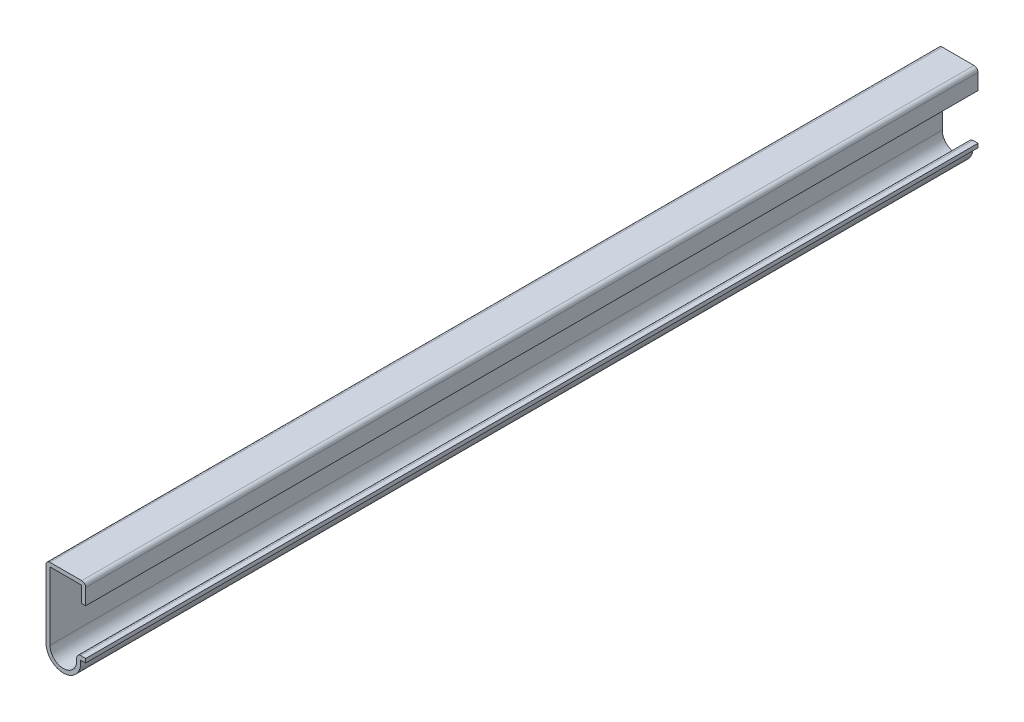
ISO-10303-21;
HEADER;
FILE_DESCRIPTION(('STEP AP214'),'2;1');
FILE_NAME('part.step','',(''),(''),'','','');
FILE_SCHEMA(('AUTOMOTIVE_DESIGN { 1 0 10303 214 1 1 1 1 }'));
ENDSEC;
DATA;
#1=APPLICATION_CONTEXT('core data for automotive mechanical design processes');
#2=APPLICATION_PROTOCOL_DEFINITION('international standard','automotive_design',2000,#1);
#3=PRODUCT_CONTEXT('',#1,'mechanical');
#4=PRODUCT('Part','Part','',(#3));
#5=PRODUCT_RELATED_PRODUCT_CATEGORY('part','',(#4));
#6=PRODUCT_DEFINITION_FORMATION('','',#4);
#7=PRODUCT_DEFINITION_CONTEXT('part definition',#1,'design');
#8=PRODUCT_DEFINITION('design','',#6,#7);
#9=PRODUCT_DEFINITION_SHAPE('','',#8);
#10=(LENGTH_UNIT() NAMED_UNIT(*) SI_UNIT(.MILLI.,.METRE.));
#11=(NAMED_UNIT(*) PLANE_ANGLE_UNIT() SI_UNIT($,.RADIAN.));
#12=(NAMED_UNIT(*) SI_UNIT($,.STERADIAN.) SOLID_ANGLE_UNIT());
#13=UNCERTAINTY_MEASURE_WITH_UNIT(LENGTH_MEASURE(1.E-05),#10,'distance_accuracy_value','');
#14=(GEOMETRIC_REPRESENTATION_CONTEXT(3) GLOBAL_UNCERTAINTY_ASSIGNED_CONTEXT((#13)) GLOBAL_UNIT_ASSIGNED_CONTEXT((#10,
#11,#12)) REPRESENTATION_CONTEXT('',''));
#15=CARTESIAN_POINT('',(0.,0.,0.));
#16=DIRECTION('',(0.,0.,1.));
#17=DIRECTION('',(1.,0.,0.));
#18=AXIS2_PLACEMENT_3D('',#15,#16,#17);
#19=CARTESIAN_POINT('',(-1.27,22.225,-285.75));
#20=DIRECTION('',(-1.,0.,0.));
#21=DIRECTION('',(0.,-1.,0.));
#22=AXIS2_PLACEMENT_3D('',#19,#20,#21);
#23=PLANE('',#22);
#24=DIRECTION('',(0.,-1.,0.));
#25=VECTOR('',#24,1.);
#26=CARTESIAN_POINT('',(-1.27,22.225,0.));
#27=LINE('',#26,#25);
#28=CARTESIAN_POINT('',(-1.27,20.955,0.));
#29=VERTEX_POINT('',#28);
#30=CARTESIAN_POINT('',(-1.27,15.875,0.));
#31=VERTEX_POINT('',#30);
#32=EDGE_CURVE('E235',#29,#31,#27,.T.);
#33=ORIENTED_EDGE('',*,*,#32,.F.);
#34=DIRECTION('',(0.,0.,1.));
#35=VECTOR('',#34,1.);
#36=CARTESIAN_POINT('',(-1.27,20.955,-285.75));
#37=LINE('',#36,#35);
#38=CARTESIAN_POINT('',(-1.27,20.955,-285.75));
#39=VERTEX_POINT('',#38);
#40=EDGE_CURVE('E190',#39,#29,#37,.T.);
#41=ORIENTED_EDGE('',*,*,#40,.F.);
#42=DIRECTION('',(0.,-1.,0.));
#43=VECTOR('',#42,1.);
#44=CARTESIAN_POINT('',(-1.27,22.225,-285.75));
#45=LINE('',#44,#43);
#46=CARTESIAN_POINT('',(-1.27,15.875,-285.75));
#47=VERTEX_POINT('',#46);
#48=EDGE_CURVE('E169',#39,#47,#45,.T.);
#49=ORIENTED_EDGE('',*,*,#48,.T.);
#50=DIRECTION('',(0.,0.,1.));
#51=VECTOR('',#50,1.);
#52=CARTESIAN_POINT('',(-1.27,15.875,-285.75));
#53=LINE('',#52,#51);
#54=EDGE_CURVE('E179',#47,#31,#53,.T.);
#55=ORIENTED_EDGE('',*,*,#54,.T.);
#56=EDGE_LOOP('',(#33,#41,#49,#55));
#57=FACE_BOUND('',#56,.T.);
#58=ADVANCED_FACE('F41',(#57),#23,.T.);
#59=CARTESIAN_POINT('',(-12.7,20.955,-285.75));
#60=DIRECTION('',(0.,-1.,0.));
#61=DIRECTION('',(0.,0.,-1.));
#62=AXIS2_PLACEMENT_3D('',#59,#60,#61);
#63=PLANE('',#62);
#64=DIRECTION('',(1.,0.,0.));
#65=VECTOR('',#64,1.);
#66=CARTESIAN_POINT('',(-12.7,20.955,0.));
#67=LINE('',#66,#65);
#68=CARTESIAN_POINT('',(-11.43,20.955,0.));
#69=VERTEX_POINT('',#68);
#70=EDGE_CURVE('E192',#69,#29,#67,.T.);
#71=ORIENTED_EDGE('',*,*,#70,.F.);
#72=DIRECTION('',(0.,0.,1.));
#73=VECTOR('',#72,1.);
#74=CARTESIAN_POINT('',(-11.43,20.955,-285.75));
#75=LINE('',#74,#73);
#76=CARTESIAN_POINT('',(-11.43,20.955,-285.75));
#77=VERTEX_POINT('',#76);
#78=EDGE_CURVE('E279',#77,#69,#75,.T.);
#79=ORIENTED_EDGE('',*,*,#78,.F.);
#80=DIRECTION('',(1.,0.,0.));
#81=VECTOR('',#80,1.);
#82=CARTESIAN_POINT('',(-12.7,20.955,-285.75));
#83=LINE('',#82,#81);
#84=EDGE_CURVE('E188',#77,#39,#83,.T.);
#85=ORIENTED_EDGE('',*,*,#84,.T.);
#86=ORIENTED_EDGE('',*,*,#40,.T.);
#87=EDGE_LOOP('',(#71,#79,#85,#86));
#88=FACE_BOUND('',#87,.T.);
#89=ADVANCED_FACE('F389',(#88),#63,.T.);
#90=CARTESIAN_POINT('',(-11.43,-0.793750000000003,-285.75));
#91=DIRECTION('',(1.,0.,0.));
#92=DIRECTION('',(0.,0.,-1.));
#93=AXIS2_PLACEMENT_3D('',#90,#91,#92);
#94=PLANE('',#93);
#95=DIRECTION('',(0.,1.,0.));
#96=VECTOR('',#95,1.);
#97=CARTESIAN_POINT('',(-11.43,-0.793750000000003,0.));
#98=LINE('',#97,#96);
#99=CARTESIAN_POINT('',(-11.43,-0.793750000000003,0.));
#100=VERTEX_POINT('',#99);
#101=EDGE_CURVE('E196',#100,#69,#98,.T.);
#102=ORIENTED_EDGE('',*,*,#101,.F.);
#103=DIRECTION('',(0.,0.,1.));
#104=VECTOR('',#103,1.);
#105=CARTESIAN_POINT('',(-11.43,-0.793750000000003,-285.75));
#106=LINE('',#105,#104);
#107=CARTESIAN_POINT('',(-11.43,-0.793750000000003,-285.75));
#108=VERTEX_POINT('',#107);
#109=EDGE_CURVE('E282',#108,#100,#106,.T.);
#110=ORIENTED_EDGE('',*,*,#109,.F.);
#111=DIRECTION('',(0.,1.,0.));
#112=VECTOR('',#111,1.);
#113=CARTESIAN_POINT('',(-11.43,-0.793750000000003,-285.75));
#114=LINE('',#113,#112);
#115=EDGE_CURVE('E229',#108,#77,#114,.T.);
#116=ORIENTED_EDGE('',*,*,#115,.T.);
#117=ORIENTED_EDGE('',*,*,#78,.T.);
#118=EDGE_LOOP('',(#102,#110,#116,#117));
#119=FACE_BOUND('',#118,.T.);
#120=ADVANCED_FACE('F409',(#119),#94,.T.);
#121=CARTESIAN_POINT('',(-7.14375,-0.793750000000003,-285.75));
#122=DIRECTION('',(0.,0.,1.));
#123=DIRECTION('',(1.,0.,0.));
#124=AXIS2_PLACEMENT_3D('',#121,#122,#123);
#125=CYLINDRICAL_SURFACE('',#124,4.28625);
#126=CARTESIAN_POINT('',(-7.14375,-0.793750000000003,0.));
#127=DIRECTION('',(0.,0.,1.));
#128=DIRECTION('',(1.,0.,0.));
#129=AXIS2_PLACEMENT_3D('',#126,#127,#128);
#130=CIRCLE('',#129,4.28625);
#131=CARTESIAN_POINT('',(-2.8575,-0.793750000000003,0.));
#132=VERTEX_POINT('',#131);
#133=EDGE_CURVE('E269',#132,#100,#130,.F.);
#134=ORIENTED_EDGE('',*,*,#133,.F.);
#135=DIRECTION('',(0.,0.,1.));
#136=VECTOR('',#135,1.);
#137=CARTESIAN_POINT('',(-2.8575,-0.793750000000003,-285.75));
#138=LINE('',#137,#136);
#139=CARTESIAN_POINT('',(-2.8575,-0.793750000000003,-285.75));
#140=VERTEX_POINT('',#139);
#141=EDGE_CURVE('E285',#140,#132,#138,.T.);
#142=ORIENTED_EDGE('',*,*,#141,.F.);
#143=CARTESIAN_POINT('',(-7.14375,-0.793750000000003,-285.75));
#144=DIRECTION('',(0.,0.,1.));
#145=DIRECTION('',(1.,0.,0.));
#146=AXIS2_PLACEMENT_3D('',#143,#144,#145);
#147=CIRCLE('',#146,4.28625);
#148=EDGE_CURVE('E225',#140,#108,#147,.F.);
#149=ORIENTED_EDGE('',*,*,#148,.T.);
#150=ORIENTED_EDGE('',*,*,#109,.T.);
#151=EDGE_LOOP('',(#134,#142,#149,#150));
#152=FACE_BOUND('',#151,.T.);
#153=ADVANCED_FACE('F396',(#152),#125,.F.);
#154=CARTESIAN_POINT('',(-2.8575,0.,-285.75));
#155=DIRECTION('',(-1.,0.,0.));
#156=DIRECTION('',(0.,-1.,0.));
#157=AXIS2_PLACEMENT_3D('',#154,#155,#156);
#158=PLANE('',#157);
#159=DIRECTION('',(0.,-1.,0.));
#160=VECTOR('',#159,1.);
#161=CARTESIAN_POINT('',(-2.8575,0.,0.));
#162=LINE('',#161,#160);
#163=CARTESIAN_POINT('',(-2.8575,0.,0.));
#164=VERTEX_POINT('',#163);
#165=EDGE_CURVE('E266',#164,#132,#162,.T.);
#166=ORIENTED_EDGE('',*,*,#165,.F.);
#167=DIRECTION('',(0.,0.,1.));
#168=VECTOR('',#167,1.);
#169=CARTESIAN_POINT('',(-2.8575,0.,-285.75));
#170=LINE('',#169,#168);
#171=CARTESIAN_POINT('',(-2.8575,0.,-285.75));
#172=VERTEX_POINT('',#171);
#173=EDGE_CURVE('E11',#164,#172,#170,.F.);
#174=ORIENTED_EDGE('',*,*,#173,.T.);
#175=DIRECTION('',(0.,-1.,0.));
#176=VECTOR('',#175,1.);
#177=CARTESIAN_POINT('',(-2.8575,0.,-285.75));
#178=LINE('',#177,#176);
#179=EDGE_CURVE('E222',#172,#140,#178,.T.);
#180=ORIENTED_EDGE('',*,*,#179,.T.);
#181=ORIENTED_EDGE('',*,*,#141,.T.);
#182=EDGE_LOOP('',(#166,#174,#180,#181));
#183=FACE_BOUND('',#182,.T.);
#184=ADVANCED_FACE('F398',(#183),#158,.T.);
#185=CARTESIAN_POINT('',(0.,1.27,-285.75));
#186=DIRECTION('',(0.,1.,0.));
#187=DIRECTION('',(-1.,0.,0.));
#188=AXIS2_PLACEMENT_3D('',#185,#186,#187);
#189=PLANE('',#188);
#190=DIRECTION('',(-1.,0.,0.));
#191=VECTOR('',#190,1.);
#192=CARTESIAN_POINT('',(0.,1.27,-285.75));
#193=LINE('',#192,#191);
#194=CARTESIAN_POINT('',(0.,1.27,-285.75));
#195=VERTEX_POINT('',#194);
#196=CARTESIAN_POINT('',(-1.5875,1.27,-285.75));
#197=VERTEX_POINT('',#196);
#198=EDGE_CURVE('E219',#195,#197,#193,.T.);
#199=ORIENTED_EDGE('',*,*,#198,.T.);
#200=DIRECTION('',(0.,0.,1.));
#201=VECTOR('',#200,1.);
#202=CARTESIAN_POINT('',(-1.5875,1.27,-285.75));
#203=LINE('',#202,#201);
#204=CARTESIAN_POINT('',(-1.5875,1.27,0.));
#205=VERTEX_POINT('',#204);
#206=EDGE_CURVE('E50',#197,#205,#203,.T.);
#207=ORIENTED_EDGE('',*,*,#206,.T.);
#208=DIRECTION('',(-1.,0.,0.));
#209=VECTOR('',#208,1.);
#210=CARTESIAN_POINT('',(0.,1.27,0.));
#211=LINE('',#210,#209);
#212=CARTESIAN_POINT('',(0.,1.27,0.));
#213=VERTEX_POINT('',#212);
#214=EDGE_CURVE('E262',#213,#205,#211,.T.);
#215=ORIENTED_EDGE('',*,*,#214,.F.);
#216=DIRECTION('',(0.,0.,1.));
#217=VECTOR('',#216,1.);
#218=CARTESIAN_POINT('',(0.,1.27,-285.75));
#219=LINE('',#218,#217);
#220=EDGE_CURVE('E289',#195,#213,#219,.T.);
#221=ORIENTED_EDGE('',*,*,#220,.F.);
#222=EDGE_LOOP('',(#199,#207,#215,#221));
#223=FACE_BOUND('',#222,.T.);
#224=ADVANCED_FACE('F343',(#223),#189,.T.);
#225=CARTESIAN_POINT('',(0.,1.27,-285.75));
#226=DIRECTION('',(-1.,0.,0.));
#227=DIRECTION('',(0.,-1.,0.));
#228=AXIS2_PLACEMENT_3D('',#225,#226,#227);
#229=PLANE('',#228);
#230=DIRECTION('',(0.,-1.,0.));
#231=VECTOR('',#230,1.);
#232=CARTESIAN_POINT('',(0.,1.27,0.));
#233=LINE('',#232,#231);
#234=CARTESIAN_POINT('',(0.,0.,0.));
#235=VERTEX_POINT('',#234);
#236=EDGE_CURVE('E259',#213,#235,#233,.T.);
#237=ORIENTED_EDGE('',*,*,#236,.T.);
#238=DIRECTION('',(0.,0.,1.));
#239=VECTOR('',#238,1.);
#240=CARTESIAN_POINT('',(0.,0.,-285.75));
#241=LINE('',#240,#239);
#242=CARTESIAN_POINT('',(0.,0.,-285.75));
#243=VERTEX_POINT('',#242);
#244=EDGE_CURVE('E292',#243,#235,#241,.T.);
#245=ORIENTED_EDGE('',*,*,#244,.F.);
#246=DIRECTION('',(0.,-1.,0.));
#247=VECTOR('',#246,1.);
#248=CARTESIAN_POINT('',(0.,1.27,-285.75));
#249=LINE('',#248,#247);
#250=EDGE_CURVE('E216',#195,#243,#249,.T.);
#251=ORIENTED_EDGE('',*,*,#250,.F.);
#252=ORIENTED_EDGE('',*,*,#220,.T.);
#253=EDGE_LOOP('',(#237,#245,#251,#252));
#254=FACE_BOUND('',#253,.T.);
#255=ADVANCED_FACE('F354',(#254),#229,.F.);
#256=CARTESIAN_POINT('',(0.,0.,-285.75));
#257=DIRECTION('',(0.,1.,0.));
#258=DIRECTION('',(-1.,0.,0.));
#259=AXIS2_PLACEMENT_3D('',#256,#257,#258);
#260=PLANE('',#259);
#261=DIRECTION('',(-1.,0.,0.));
#262=VECTOR('',#261,1.);
#263=CARTESIAN_POINT('',(0.,0.,0.));
#264=LINE('',#263,#262);
#265=CARTESIAN_POINT('',(-1.5875,0.,0.));
#266=VERTEX_POINT('',#265);
#267=EDGE_CURVE('E256',#235,#266,#264,.T.);
#268=ORIENTED_EDGE('',*,*,#267,.T.);
#269=DIRECTION('',(0.,0.,1.));
#270=VECTOR('',#269,1.);
#271=CARTESIAN_POINT('',(-1.5875,0.,-285.75));
#272=LINE('',#271,#270);
#273=CARTESIAN_POINT('',(-1.5875,0.,-285.75));
#274=VERTEX_POINT('',#273);
#275=EDGE_CURVE('E296',#274,#266,#272,.T.);
#276=ORIENTED_EDGE('',*,*,#275,.F.);
#277=DIRECTION('',(-1.,0.,0.));
#278=VECTOR('',#277,1.);
#279=CARTESIAN_POINT('',(0.,0.,-285.75));
#280=LINE('',#279,#278);
#281=EDGE_CURVE('E213',#243,#274,#280,.T.);
#282=ORIENTED_EDGE('',*,*,#281,.F.);
#283=ORIENTED_EDGE('',*,*,#244,.T.);
#284=EDGE_LOOP('',(#268,#276,#282,#283));
#285=FACE_BOUND('',#284,.T.);
#286=ADVANCED_FACE('F358',(#285),#260,.F.);
#287=CARTESIAN_POINT('',(-1.5875,0.,-285.75));
#288=DIRECTION('',(-1.,0.,0.));
#289=DIRECTION('',(0.,-1.,0.));
#290=AXIS2_PLACEMENT_3D('',#287,#288,#289);
#291=PLANE('',#290);
#292=DIRECTION('',(0.,-1.,0.));
#293=VECTOR('',#292,1.);
#294=CARTESIAN_POINT('',(-1.5875,0.,0.));
#295=LINE('',#294,#293);
#296=CARTESIAN_POINT('',(-1.5875,-0.793750000000003,0.));
#297=VERTEX_POINT('',#296);
#298=EDGE_CURVE('E253',#266,#297,#295,.T.);
#299=ORIENTED_EDGE('',*,*,#298,.T.);
#300=DIRECTION('',(0.,0.,1.));
#301=VECTOR('',#300,1.);
#302=CARTESIAN_POINT('',(-1.5875,-0.793750000000003,-285.75));
#303=LINE('',#302,#301);
#304=CARTESIAN_POINT('',(-1.5875,-0.793750000000003,-285.75));
#305=VERTEX_POINT('',#304);
#306=EDGE_CURVE('E300',#305,#297,#303,.T.);
#307=ORIENTED_EDGE('',*,*,#306,.F.);
#308=DIRECTION('',(0.,-1.,0.));
#309=VECTOR('',#308,1.);
#310=CARTESIAN_POINT('',(-1.5875,0.,-285.75));
#311=LINE('',#310,#309);
#312=EDGE_CURVE('E210',#274,#305,#311,.T.);
#313=ORIENTED_EDGE('',*,*,#312,.F.);
#314=ORIENTED_EDGE('',*,*,#275,.T.);
#315=EDGE_LOOP('',(#299,#307,#313,#314));
#316=FACE_BOUND('',#315,.T.);
#317=ADVANCED_FACE('F365',(#316),#291,.F.);
#318=CARTESIAN_POINT('',(-7.14375,-0.793750000000003,-285.75));
#319=DIRECTION('',(0.,0.,1.));
#320=DIRECTION('',(1.,0.,0.));
#321=AXIS2_PLACEMENT_3D('',#318,#319,#320);
#322=CYLINDRICAL_SURFACE('',#321,5.55625);
#323=CARTESIAN_POINT('',(-7.14375,-0.793750000000003,0.));
#324=DIRECTION('',(0.,0.,-1.));
#325=DIRECTION('',(-1.,0.,0.));
#326=AXIS2_PLACEMENT_3D('',#323,#324,#325);
#327=CIRCLE('',#326,5.55625);
#328=CARTESIAN_POINT('',(-12.7,-0.793750000000003,0.));
#329=VERTEX_POINT('',#328);
#330=EDGE_CURVE('E250',#297,#329,#327,.T.);
#331=ORIENTED_EDGE('',*,*,#330,.T.);
#332=DIRECTION('',(0.,0.,1.));
#333=VECTOR('',#332,1.);
#334=CARTESIAN_POINT('',(-12.7,-0.793750000000003,-285.75));
#335=LINE('',#334,#333);
#336=CARTESIAN_POINT('',(-12.7,-0.793750000000003,-285.75));
#337=VERTEX_POINT('',#336);
#338=EDGE_CURVE('E304',#337,#329,#335,.T.);
#339=ORIENTED_EDGE('',*,*,#338,.F.);
#340=CARTESIAN_POINT('',(-7.14375,-0.793750000000003,-285.75));
#341=DIRECTION('',(0.,0.,-1.));
#342=DIRECTION('',(-1.,0.,0.));
#343=AXIS2_PLACEMENT_3D('',#340,#341,#342);
#344=CIRCLE('',#343,5.55625);
#345=EDGE_CURVE('E207',#305,#337,#344,.T.);
#346=ORIENTED_EDGE('',*,*,#345,.F.);
#347=ORIENTED_EDGE('',*,*,#306,.T.);
#348=EDGE_LOOP('',(#331,#339,#346,#347));
#349=FACE_BOUND('',#348,.T.);
#350=ADVANCED_FACE('F368',(#349),#322,.T.);
#351=CARTESIAN_POINT('',(-12.7,-0.793750000000003,-285.75));
#352=DIRECTION('',(1.,0.,0.));
#353=DIRECTION('',(0.,0.,-1.));
#354=AXIS2_PLACEMENT_3D('',#351,#352,#353);
#355=PLANE('',#354);
#356=DIRECTION('',(0.,1.,0.));
#357=VECTOR('',#356,1.);
#358=CARTESIAN_POINT('',(-12.7,-0.793750000000003,0.));
#359=LINE('',#358,#357);
#360=CARTESIAN_POINT('',(-12.7,20.955,0.));
#361=VERTEX_POINT('',#360);
#362=EDGE_CURVE('E247',#329,#361,#359,.T.);
#363=ORIENTED_EDGE('',*,*,#362,.T.);
#364=DIRECTION('',(0.,0.,1.));
#365=VECTOR('',#364,1.);
#366=CARTESIAN_POINT('',(-12.7,20.955,-285.75));
#367=LINE('',#366,#365);
#368=CARTESIAN_POINT('',(-12.7,20.955,-285.75));
#369=VERTEX_POINT('',#368);
#370=EDGE_CURVE('E57',#361,#369,#367,.F.);
#371=ORIENTED_EDGE('',*,*,#370,.T.);
#372=DIRECTION('',(0.,1.,0.));
#373=VECTOR('',#372,1.);
#374=CARTESIAN_POINT('',(-12.7,-0.793750000000003,-285.75));
#375=LINE('',#374,#373);
#376=EDGE_CURVE('E204',#337,#369,#375,.T.);
#377=ORIENTED_EDGE('',*,*,#376,.F.);
#378=ORIENTED_EDGE('',*,*,#338,.T.);
#379=EDGE_LOOP('',(#363,#371,#377,#378));
#380=FACE_BOUND('',#379,.T.);
#381=ADVANCED_FACE('F370',(#380),#355,.F.);
#382=CARTESIAN_POINT('',(-12.7,22.225,-285.75));
#383=DIRECTION('',(0.,-1.,0.));
#384=DIRECTION('',(0.,0.,-1.));
#385=AXIS2_PLACEMENT_3D('',#382,#383,#384);
#386=PLANE('',#385);
#387=DIRECTION('',(1.,0.,0.));
#388=VECTOR('',#387,1.);
#389=CARTESIAN_POINT('',(-12.7,22.225,0.));
#390=LINE('',#389,#388);
#391=CARTESIAN_POINT('',(-11.43,22.225,0.));
#392=VERTEX_POINT('',#391);
#393=CARTESIAN_POINT('',(-1.27,22.225,0.));
#394=VERTEX_POINT('',#393);
#395=EDGE_CURVE('E243',#392,#394,#390,.T.);
#396=ORIENTED_EDGE('',*,*,#395,.T.);
#397=DIRECTION('',(0.,0.,1.));
#398=VECTOR('',#397,1.);
#399=CARTESIAN_POINT('',(-1.27,22.225,-285.75));
#400=LINE('',#399,#398);
#401=CARTESIAN_POINT('',(-1.27,22.225,-285.75));
#402=VERTEX_POINT('',#401);
#403=EDGE_CURVE('E326',#394,#402,#400,.F.);
#404=ORIENTED_EDGE('',*,*,#403,.T.);
#405=DIRECTION('',(1.,0.,0.));
#406=VECTOR('',#405,1.);
#407=CARTESIAN_POINT('',(-12.7,22.225,-285.75));
#408=LINE('',#407,#406);
#409=CARTESIAN_POINT('',(-11.43,22.225,-285.75));
#410=VERTEX_POINT('',#409);
#411=EDGE_CURVE('E201',#410,#402,#408,.T.);
#412=ORIENTED_EDGE('',*,*,#411,.F.);
#413=DIRECTION('',(0.,0.,1.));
#414=VECTOR('',#413,1.);
#415=CARTESIAN_POINT('',(-11.43,22.225,-285.75));
#416=LINE('',#415,#414);
#417=EDGE_CURVE('E322',#410,#392,#416,.T.);
#418=ORIENTED_EDGE('',*,*,#417,.T.);
#419=EDGE_LOOP('',(#396,#404,#412,#418));
#420=FACE_BOUND('',#419,.T.);
#421=ADVANCED_FACE('F378',(#420),#386,.F.);
#422=CARTESIAN_POINT('',(0.,22.225,-285.75));
#423=DIRECTION('',(-1.,0.,0.));
#424=DIRECTION('',(0.,-1.,0.));
#425=AXIS2_PLACEMENT_3D('',#422,#423,#424);
#426=PLANE('',#425);
#427=DIRECTION('',(0.,-1.,0.));
#428=VECTOR('',#427,1.);
#429=CARTESIAN_POINT('',(0.,22.225,-285.75));
#430=LINE('',#429,#428);
#431=CARTESIAN_POINT('',(0.,20.955,-285.75));
#432=VERTEX_POINT('',#431);
#433=CARTESIAN_POINT('',(0.,15.875,-285.75));
#434=VERTEX_POINT('',#433);
#435=EDGE_CURVE('E172',#432,#434,#430,.T.);
#436=ORIENTED_EDGE('',*,*,#435,.F.);
#437=DIRECTION('',(0.,0.,1.));
#438=VECTOR('',#437,1.);
#439=CARTESIAN_POINT('',(0.,20.955,-285.75));
#440=LINE('',#439,#438);
#441=CARTESIAN_POINT('',(0.,20.955,0.));
#442=VERTEX_POINT('',#441);
#443=EDGE_CURVE('E278',#432,#442,#440,.T.);
#444=ORIENTED_EDGE('',*,*,#443,.T.);
#445=DIRECTION('',(0.,-1.,0.));
#446=VECTOR('',#445,1.);
#447=CARTESIAN_POINT('',(0.,22.225,0.));
#448=LINE('',#447,#446);
#449=CARTESIAN_POINT('',(0.,15.875,0.));
#450=VERTEX_POINT('',#449);
#451=EDGE_CURVE('E240',#442,#450,#448,.T.);
#452=ORIENTED_EDGE('',*,*,#451,.T.);
#453=DIRECTION('',(0.,0.,1.));
#454=VECTOR('',#453,1.);
#455=CARTESIAN_POINT('',(0.,15.875,-285.75));
#456=LINE('',#455,#454);
#457=EDGE_CURVE('E187',#434,#450,#456,.T.);
#458=ORIENTED_EDGE('',*,*,#457,.F.);
#459=EDGE_LOOP('',(#436,#444,#452,#458));
#460=FACE_BOUND('',#459,.T.);
#461=ADVANCED_FACE('F385',(#460),#426,.F.);
#462=CARTESIAN_POINT('',(0.,15.875,-285.75));
#463=DIRECTION('',(0.,1.,0.));
#464=DIRECTION('',(0.,0.,1.));
#465=AXIS2_PLACEMENT_3D('',#462,#463,#464);
#466=PLANE('',#465);
#467=DIRECTION('',(-1.,0.,0.));
#468=VECTOR('',#467,1.);
#469=CARTESIAN_POINT('',(0.,15.875,0.));
#470=LINE('',#469,#468);
#471=EDGE_CURVE('E182',#450,#31,#470,.T.);
#472=ORIENTED_EDGE('',*,*,#471,.T.);
#473=ORIENTED_EDGE('',*,*,#54,.F.);
#474=DIRECTION('',(-1.,0.,0.));
#475=VECTOR('',#474,1.);
#476=CARTESIAN_POINT('',(0.,15.875,-285.75));
#477=LINE('',#476,#475);
#478=EDGE_CURVE('E163',#434,#47,#477,.T.);
#479=ORIENTED_EDGE('',*,*,#478,.F.);
#480=ORIENTED_EDGE('',*,*,#457,.T.);
#481=EDGE_LOOP('',(#472,#473,#479,#480));
#482=FACE_BOUND('',#481,.T.);
#483=ADVANCED_FACE('F180',(#482),#466,.F.);
#484=CARTESIAN_POINT('',(-7.14375,-0.793750000000003,-285.75));
#485=DIRECTION('',(0.,0.,-1.));
#486=DIRECTION('',(-1.,0.,0.));
#487=AXIS2_PLACEMENT_3D('',#484,#485,#486);
#488=PLANE('',#487);
#489=ORIENTED_EDGE('',*,*,#411,.T.);
#490=CARTESIAN_POINT('',(-1.27,20.955,-285.75));
#491=DIRECTION('',(0.,0.,-1.));
#492=DIRECTION('',(-1.,0.,0.));
#493=AXIS2_PLACEMENT_3D('',#490,#491,#492);
#494=CIRCLE('',#493,1.27);
#495=EDGE_CURVE('E334',#402,#432,#494,.T.);
#496=ORIENTED_EDGE('',*,*,#495,.T.);
#497=ORIENTED_EDGE('',*,*,#435,.T.);
#498=ORIENTED_EDGE('',*,*,#478,.T.);
#499=ORIENTED_EDGE('',*,*,#48,.F.);
#500=ORIENTED_EDGE('',*,*,#84,.F.);
#501=ORIENTED_EDGE('',*,*,#115,.F.);
#502=ORIENTED_EDGE('',*,*,#148,.F.);
#503=ORIENTED_EDGE('',*,*,#179,.F.);
#504=CARTESIAN_POINT('',(-1.5875,0.,-285.75));
#505=DIRECTION('',(0.,0.,-1.));
#506=DIRECTION('',(-1.,0.,0.));
#507=AXIS2_PLACEMENT_3D('',#504,#505,#506);
#508=CIRCLE('',#507,1.27);
#509=EDGE_CURVE('E65',#172,#197,#508,.T.);
#510=ORIENTED_EDGE('',*,*,#509,.T.);
#511=ORIENTED_EDGE('',*,*,#198,.F.);
#512=ORIENTED_EDGE('',*,*,#250,.T.);
#513=ORIENTED_EDGE('',*,*,#281,.T.);
#514=ORIENTED_EDGE('',*,*,#312,.T.);
#515=ORIENTED_EDGE('',*,*,#345,.T.);
#516=ORIENTED_EDGE('',*,*,#376,.T.);
#517=CARTESIAN_POINT('',(-11.43,20.955,-285.75));
#518=DIRECTION('',(0.,0.,-1.));
#519=DIRECTION('',(-1.,0.,0.));
#520=AXIS2_PLACEMENT_3D('',#517,#518,#519);
#521=CIRCLE('',#520,1.27);
#522=EDGE_CURVE('E331',#369,#410,#521,.T.);
#523=ORIENTED_EDGE('',*,*,#522,.T.);
#524=EDGE_LOOP('',(#489,#496,#497,#498,#499,#500,#501,#502,#503,#510,#511,#512,#513,#514,#515,
#516,#523));
#525=FACE_BOUND('',#524,.T.);
#526=ADVANCED_FACE('F166',(#525),#488,.T.);
#527=CARTESIAN_POINT('',(-7.14375,-0.793750000000003,0.));
#528=DIRECTION('',(0.,0.,-1.));
#529=DIRECTION('',(-1.,0.,0.));
#530=AXIS2_PLACEMENT_3D('',#527,#528,#529);
#531=PLANE('',#530);
#532=ORIENTED_EDGE('',*,*,#451,.F.);
#533=CARTESIAN_POINT('',(-1.27,20.955,0.));
#534=DIRECTION('',(0.,0.,-1.));
#535=DIRECTION('',(-1.,0.,0.));
#536=AXIS2_PLACEMENT_3D('',#533,#534,#535);
#537=CIRCLE('',#536,1.27);
#538=EDGE_CURVE('E319',#442,#394,#537,.F.);
#539=ORIENTED_EDGE('',*,*,#538,.T.);
#540=ORIENTED_EDGE('',*,*,#395,.F.);
#541=CARTESIAN_POINT('',(-11.43,20.955,0.));
#542=DIRECTION('',(0.,0.,-1.));
#543=DIRECTION('',(-1.,0.,0.));
#544=AXIS2_PLACEMENT_3D('',#541,#542,#543);
#545=CIRCLE('',#544,1.27);
#546=EDGE_CURVE('E316',#392,#361,#545,.F.);
#547=ORIENTED_EDGE('',*,*,#546,.T.);
#548=ORIENTED_EDGE('',*,*,#362,.F.);
#549=ORIENTED_EDGE('',*,*,#330,.F.);
#550=ORIENTED_EDGE('',*,*,#298,.F.);
#551=ORIENTED_EDGE('',*,*,#267,.F.);
#552=ORIENTED_EDGE('',*,*,#236,.F.);
#553=ORIENTED_EDGE('',*,*,#214,.T.);
#554=CARTESIAN_POINT('',(-1.5875,0.,0.));
#555=DIRECTION('',(0.,0.,-1.));
#556=DIRECTION('',(-1.,0.,0.));
#557=AXIS2_PLACEMENT_3D('',#554,#555,#556);
#558=CIRCLE('',#557,1.27);
#559=EDGE_CURVE('E313',#205,#164,#558,.F.);
#560=ORIENTED_EDGE('',*,*,#559,.T.);
#561=ORIENTED_EDGE('',*,*,#165,.T.);
#562=ORIENTED_EDGE('',*,*,#133,.T.);
#563=ORIENTED_EDGE('',*,*,#101,.T.);
#564=ORIENTED_EDGE('',*,*,#70,.T.);
#565=ORIENTED_EDGE('',*,*,#32,.T.);
#566=ORIENTED_EDGE('',*,*,#471,.F.);
#567=EDGE_LOOP('',(#532,#539,#540,#547,#548,#549,#550,#551,#552,#553,#560,#561,#562,#563,#564,
#565,#566));
#568=FACE_BOUND('',#567,.T.);
#569=ADVANCED_FACE('F348',(#568),#531,.F.);
#570=CARTESIAN_POINT('',(-1.27,20.955,-285.75));
#571=DIRECTION('',(0.,0.,1.));
#572=DIRECTION('',(1.,0.,0.));
#573=AXIS2_PLACEMENT_3D('',#570,#571,#572);
#574=CYLINDRICAL_SURFACE('',#573,1.27);
#575=ORIENTED_EDGE('',*,*,#495,.F.);
#576=ORIENTED_EDGE('',*,*,#403,.F.);
#577=ORIENTED_EDGE('',*,*,#538,.F.);
#578=ORIENTED_EDGE('',*,*,#443,.F.);
#579=EDGE_LOOP('',(#575,#576,#577,#578));
#580=FACE_BOUND('',#579,.T.);
#581=ADVANCED_FACE('F383',(#580),#574,.T.);
#582=CARTESIAN_POINT('',(-11.43,20.955,-285.75));
#583=DIRECTION('',(0.,0.,1.));
#584=DIRECTION('',(1.,0.,0.));
#585=AXIS2_PLACEMENT_3D('',#582,#583,#584);
#586=CYLINDRICAL_SURFACE('',#585,1.27);
#587=ORIENTED_EDGE('',*,*,#522,.F.);
#588=ORIENTED_EDGE('',*,*,#370,.F.);
#589=ORIENTED_EDGE('',*,*,#546,.F.);
#590=ORIENTED_EDGE('',*,*,#417,.F.);
#591=EDGE_LOOP('',(#587,#588,#589,#590));
#592=FACE_BOUND('',#591,.T.);
#593=ADVANCED_FACE('F375',(#592),#586,.T.);
#594=CARTESIAN_POINT('',(-1.5875,0.,-285.75));
#595=DIRECTION('',(0.,0.,1.));
#596=DIRECTION('',(1.,0.,0.));
#597=AXIS2_PLACEMENT_3D('',#594,#595,#596);
#598=CYLINDRICAL_SURFACE('',#597,1.27);
#599=ORIENTED_EDGE('',*,*,#509,.F.);
#600=ORIENTED_EDGE('',*,*,#173,.F.);
#601=ORIENTED_EDGE('',*,*,#559,.F.);
#602=ORIENTED_EDGE('',*,*,#206,.F.);
#603=EDGE_LOOP('',(#599,#600,#601,#602));
#604=FACE_BOUND('',#603,.T.);
#605=ADVANCED_FACE('F43',(#604),#598,.T.);
#606=CLOSED_SHELL('',(#58,#89,#120,#153,#184,#224,#255,#286,#317,#350,#381,#421,#461,#483,#526,
#569,#581,#593,#605));
#607=MANIFOLD_SOLID_BREP('B2',#606);
#608=ADVANCED_BREP_SHAPE_REPRESENTATION('',(#18,#607),#14);
#609=SHAPE_DEFINITION_REPRESENTATION(#9,#608);
ENDSEC;
END-ISO-10303-21;
